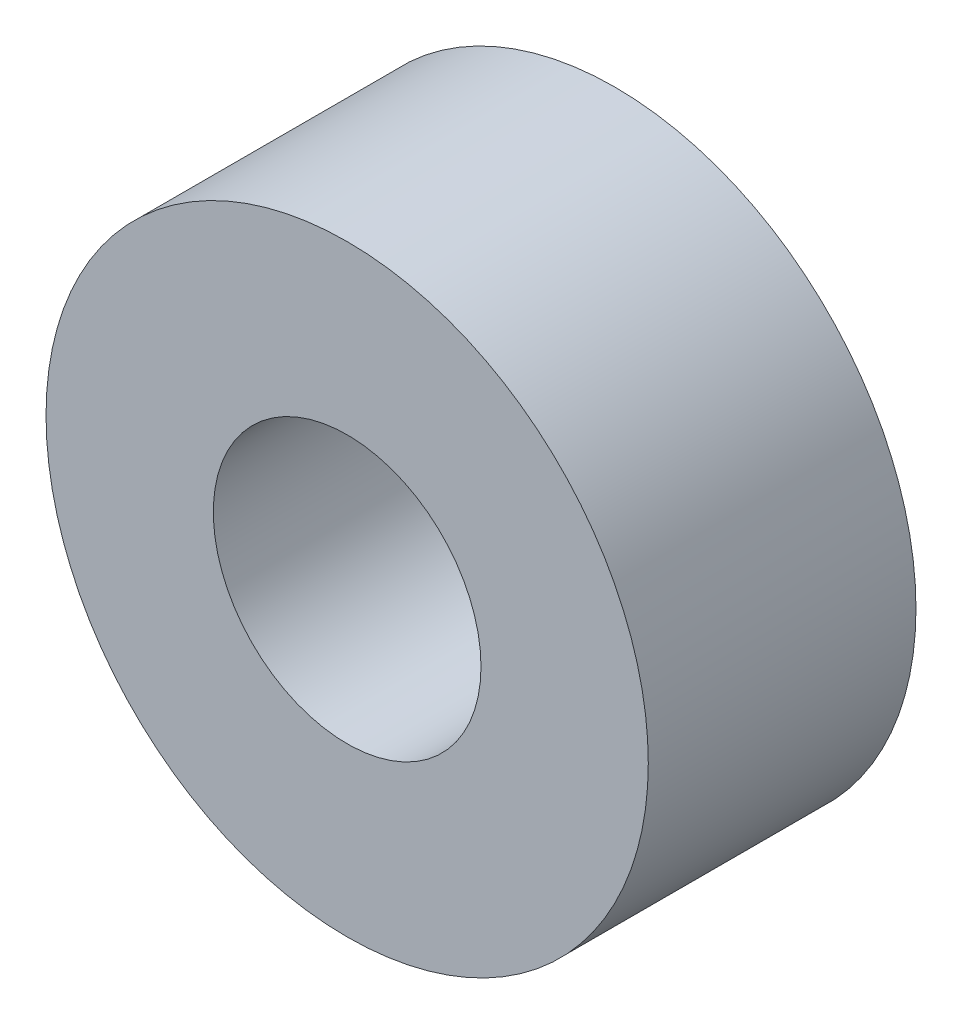
ISO-10303-21;
HEADER;
FILE_DESCRIPTION(('STEP AP214'),'2;1');
FILE_NAME('part.step','',(''),(''),'','','');
FILE_SCHEMA(('AUTOMOTIVE_DESIGN { 1 0 10303 214 1 1 1 1 }'));
ENDSEC;
DATA;
#1=APPLICATION_CONTEXT('core data for automotive mechanical design processes');
#2=APPLICATION_PROTOCOL_DEFINITION('international standard','automotive_design',2000,#1);
#3=PRODUCT_CONTEXT('',#1,'mechanical');
#4=PRODUCT('Part','Part','',(#3));
#5=PRODUCT_RELATED_PRODUCT_CATEGORY('part','',(#4));
#6=PRODUCT_DEFINITION_FORMATION('','',#4);
#7=PRODUCT_DEFINITION_CONTEXT('part definition',#1,'design');
#8=PRODUCT_DEFINITION('design','',#6,#7);
#9=PRODUCT_DEFINITION_SHAPE('','',#8);
#10=(LENGTH_UNIT() NAMED_UNIT(*) SI_UNIT(.MILLI.,.METRE.));
#11=(NAMED_UNIT(*) PLANE_ANGLE_UNIT() SI_UNIT($,.RADIAN.));
#12=(NAMED_UNIT(*) SI_UNIT($,.STERADIAN.) SOLID_ANGLE_UNIT());
#13=UNCERTAINTY_MEASURE_WITH_UNIT(LENGTH_MEASURE(1.E-05),#10,'distance_accuracy_value','');
#14=(GEOMETRIC_REPRESENTATION_CONTEXT(3) GLOBAL_UNCERTAINTY_ASSIGNED_CONTEXT((#13)) GLOBAL_UNIT_ASSIGNED_CONTEXT((#10,
#11,#12)) REPRESENTATION_CONTEXT('',''));
#15=CARTESIAN_POINT('',(0.,0.,0.));
#16=DIRECTION('',(0.,0.,1.));
#17=DIRECTION('',(1.,0.,0.));
#18=AXIS2_PLACEMENT_3D('',#15,#16,#17);
#19=CARTESIAN_POINT('',(0.,0.,4.));
#20=DIRECTION('',(0.,0.,1.));
#21=DIRECTION('',(1.,0.,0.));
#22=AXIS2_PLACEMENT_3D('',#19,#20,#21);
#23=PLANE('',#22);
#24=CARTESIAN_POINT('',(0.,0.,4.));
#25=DIRECTION('',(0.,0.,1.));
#26=DIRECTION('',(1.,0.,0.));
#27=AXIS2_PLACEMENT_3D('',#24,#25,#26);
#28=CIRCLE('',#27,4.5);
#29=CARTESIAN_POINT('',(4.5,0.,4.));
#30=VERTEX_POINT('',#29);
#31=EDGE_CURVE('E10',#30,#30,#28,.T.);
#32=ORIENTED_EDGE('',*,*,#31,.T.);
#33=EDGE_LOOP('',(#32));
#34=FACE_BOUND('',#33,.T.);
#35=CARTESIAN_POINT('',(0.,0.,4.));
#36=DIRECTION('',(0.,0.,1.));
#37=DIRECTION('',(1.,0.,0.));
#38=AXIS2_PLACEMENT_3D('',#35,#36,#37);
#39=CIRCLE('',#38,2.);
#40=CARTESIAN_POINT('',(2.,0.,4.));
#41=VERTEX_POINT('',#40);
#42=EDGE_CURVE('E46',#41,#41,#39,.T.);
#43=ORIENTED_EDGE('',*,*,#42,.F.);
#44=EDGE_LOOP('',(#43));
#45=FACE_BOUND('',#44,.T.);
#46=ADVANCED_FACE('F35',(#34,#45),#23,.T.);
#47=CARTESIAN_POINT('',(0.,0.,0.));
#48=DIRECTION('',(0.,0.,1.));
#49=DIRECTION('',(1.,0.,0.));
#50=AXIS2_PLACEMENT_3D('',#47,#48,#49);
#51=PLANE('',#50);
#52=CARTESIAN_POINT('',(0.,0.,0.));
#53=DIRECTION('',(0.,0.,1.));
#54=DIRECTION('',(1.,0.,0.));
#55=AXIS2_PLACEMENT_3D('',#52,#53,#54);
#56=CIRCLE('',#55,4.5);
#57=CARTESIAN_POINT('',(4.5,0.,0.));
#58=VERTEX_POINT('',#57);
#59=EDGE_CURVE('E39',#58,#58,#56,.T.);
#60=ORIENTED_EDGE('',*,*,#59,.F.);
#61=EDGE_LOOP('',(#60));
#62=FACE_BOUND('',#61,.T.);
#63=CARTESIAN_POINT('',(0.,0.,0.));
#64=DIRECTION('',(0.,0.,1.));
#65=DIRECTION('',(1.,0.,0.));
#66=AXIS2_PLACEMENT_3D('',#63,#64,#65);
#67=CIRCLE('',#66,2.);
#68=CARTESIAN_POINT('',(2.,0.,0.));
#69=VERTEX_POINT('',#68);
#70=EDGE_CURVE('E48',#69,#69,#67,.T.);
#71=ORIENTED_EDGE('',*,*,#70,.T.);
#72=EDGE_LOOP('',(#71));
#73=FACE_BOUND('',#72,.T.);
#74=ADVANCED_FACE('F58',(#62,#73),#51,.F.);
#75=CARTESIAN_POINT('',(0.,0.,4.));
#76=DIRECTION('',(0.,0.,-1.));
#77=DIRECTION('',(-1.,0.,0.));
#78=AXIS2_PLACEMENT_3D('',#75,#76,#77);
#79=CYLINDRICAL_SURFACE('',#78,4.5);
#80=ORIENTED_EDGE('',*,*,#31,.F.);
#81=EDGE_LOOP('',(#80));
#82=FACE_BOUND('',#81,.T.);
#83=ORIENTED_EDGE('',*,*,#59,.T.);
#84=EDGE_LOOP('',(#83));
#85=FACE_BOUND('',#84,.T.);
#86=ADVANCED_FACE('F37',(#82,#85),#79,.T.);
#87=CARTESIAN_POINT('',(0.,0.,4.));
#88=DIRECTION('',(0.,0.,-1.));
#89=DIRECTION('',(-1.,0.,0.));
#90=AXIS2_PLACEMENT_3D('',#87,#88,#89);
#91=CYLINDRICAL_SURFACE('',#90,2.);
#92=ORIENTED_EDGE('',*,*,#42,.T.);
#93=EDGE_LOOP('',(#92));
#94=FACE_BOUND('',#93,.T.);
#95=ORIENTED_EDGE('',*,*,#70,.F.);
#96=EDGE_LOOP('',(#95));
#97=FACE_BOUND('',#96,.T.);
#98=ADVANCED_FACE('F54',(#94,#97),#91,.F.);
#99=CLOSED_SHELL('',(#46,#74,#86,#98));
#100=MANIFOLD_SOLID_BREP('B2',#99);
#101=ADVANCED_BREP_SHAPE_REPRESENTATION('',(#18,#100),#14);
#102=SHAPE_DEFINITION_REPRESENTATION(#9,#101);
ENDSEC;
END-ISO-10303-21;
